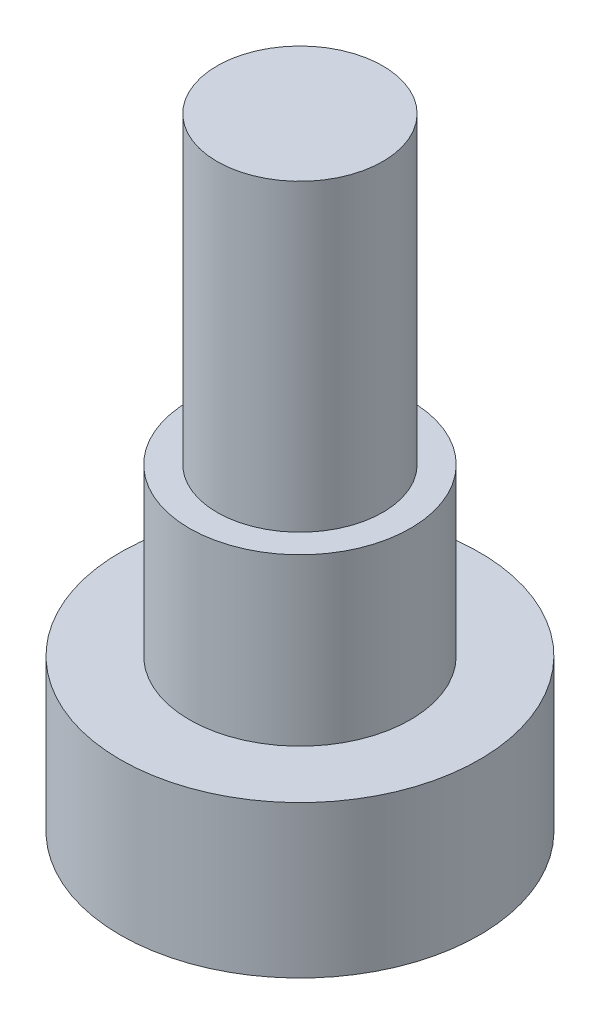
ISO-10303-21;
HEADER;
FILE_DESCRIPTION(('STEP AP214'),'2;1');
FILE_NAME('part.step','',(''),(''),'','','');
FILE_SCHEMA(('AUTOMOTIVE_DESIGN { 1 0 10303 214 1 1 1 1 }'));
ENDSEC;
DATA;
#1=APPLICATION_CONTEXT('core data for automotive mechanical design processes');
#2=APPLICATION_PROTOCOL_DEFINITION('international standard','automotive_design',2000,#1);
#3=PRODUCT_CONTEXT('',#1,'mechanical');
#4=PRODUCT('Part','Part','',(#3));
#5=PRODUCT_RELATED_PRODUCT_CATEGORY('part','',(#4));
#6=PRODUCT_DEFINITION_FORMATION('','',#4);
#7=PRODUCT_DEFINITION_CONTEXT('part definition',#1,'design');
#8=PRODUCT_DEFINITION('design','',#6,#7);
#9=PRODUCT_DEFINITION_SHAPE('','',#8);
#10=(LENGTH_UNIT() NAMED_UNIT(*) SI_UNIT(.MILLI.,.METRE.));
#11=(NAMED_UNIT(*) PLANE_ANGLE_UNIT() SI_UNIT($,.RADIAN.));
#12=(NAMED_UNIT(*) SI_UNIT($,.STERADIAN.) SOLID_ANGLE_UNIT());
#13=UNCERTAINTY_MEASURE_WITH_UNIT(LENGTH_MEASURE(1.E-05),#10,'distance_accuracy_value','');
#14=(GEOMETRIC_REPRESENTATION_CONTEXT(3) GLOBAL_UNCERTAINTY_ASSIGNED_CONTEXT((#13)) GLOBAL_UNIT_ASSIGNED_CONTEXT((#10,
#11,#12)) REPRESENTATION_CONTEXT('',''));
#15=CARTESIAN_POINT('',(0.,0.,0.));
#16=DIRECTION('',(0.,0.,1.));
#17=DIRECTION('',(1.,0.,0.));
#18=AXIS2_PLACEMENT_3D('',#15,#16,#17);
#19=CARTESIAN_POINT('',(0.,5.5,0.));
#20=DIRECTION('',(0.,-1.,0.));
#21=DIRECTION('',(0.,0.,-1.));
#22=AXIS2_PLACEMENT_3D('',#19,#20,#21);
#23=CYLINDRICAL_SURFACE('',#22,6.5);
#24=CARTESIAN_POINT('',(0.,5.5,0.));
#25=DIRECTION('',(0.,1.,0.));
#26=DIRECTION('',(0.,0.,1.));
#27=AXIS2_PLACEMENT_3D('',#24,#25,#26);
#28=CIRCLE('',#27,6.5);
#29=CARTESIAN_POINT('',(0.,5.5,6.5));
#30=VERTEX_POINT('',#29);
#31=EDGE_CURVE('E45',#30,#30,#28,.T.);
#32=ORIENTED_EDGE('',*,*,#31,.F.);
#33=EDGE_LOOP('',(#32));
#34=FACE_BOUND('',#33,.T.);
#35=CARTESIAN_POINT('',(0.,0.,0.));
#36=DIRECTION('',(0.,1.,0.));
#37=DIRECTION('',(0.,0.,1.));
#38=AXIS2_PLACEMENT_3D('',#35,#36,#37);
#39=CIRCLE('',#38,6.5);
#40=CARTESIAN_POINT('',(0.,0.,6.5));
#41=VERTEX_POINT('',#40);
#42=EDGE_CURVE('E36',#41,#41,#39,.T.);
#43=ORIENTED_EDGE('',*,*,#42,.T.);
#44=EDGE_LOOP('',(#43));
#45=FACE_BOUND('',#44,.T.);
#46=ADVANCED_FACE('F33',(#34,#45),#23,.T.);
#47=CARTESIAN_POINT('',(0.,5.5,0.));
#48=DIRECTION('',(0.,1.,0.));
#49=DIRECTION('',(0.,0.,1.));
#50=AXIS2_PLACEMENT_3D('',#47,#48,#49);
#51=PLANE('',#50);
#52=CARTESIAN_POINT('',(0.,5.5,0.));
#53=DIRECTION('',(0.,1.,0.));
#54=DIRECTION('',(0.,0.,1.));
#55=AXIS2_PLACEMENT_3D('',#52,#53,#54);
#56=CIRCLE('',#55,4.);
#57=CARTESIAN_POINT('',(0.,5.5,4.));
#58=VERTEX_POINT('',#57);
#59=EDGE_CURVE('E40',#58,#58,#56,.T.);
#60=ORIENTED_EDGE('',*,*,#59,.F.);
#61=EDGE_LOOP('',(#60));
#62=FACE_BOUND('',#61,.T.);
#63=ORIENTED_EDGE('',*,*,#31,.T.);
#64=EDGE_LOOP('',(#63));
#65=FACE_BOUND('',#64,.T.);
#66=ADVANCED_FACE('F62',(#62,#65),#51,.T.);
#67=CARTESIAN_POINT('',(0.,0.,0.));
#68=DIRECTION('',(0.,1.,0.));
#69=DIRECTION('',(0.,0.,1.));
#70=AXIS2_PLACEMENT_3D('',#67,#68,#69);
#71=PLANE('',#70);
#72=ORIENTED_EDGE('',*,*,#42,.F.);
#73=EDGE_LOOP('',(#72));
#74=FACE_BOUND('',#73,.T.);
#75=ADVANCED_FACE('F59',(#74),#71,.F.);
#76=CARTESIAN_POINT('',(0.,11.5,0.));
#77=DIRECTION('',(0.,-1.,0.));
#78=DIRECTION('',(0.,0.,-1.));
#79=AXIS2_PLACEMENT_3D('',#76,#77,#78);
#80=CYLINDRICAL_SURFACE('',#79,4.);
#81=CARTESIAN_POINT('',(0.,11.5,0.));
#82=DIRECTION('',(0.,1.,0.));
#83=DIRECTION('',(0.,0.,1.));
#84=AXIS2_PLACEMENT_3D('',#81,#82,#83);
#85=CIRCLE('',#84,4.);
#86=CARTESIAN_POINT('',(0.,11.5,4.));
#87=VERTEX_POINT('',#86);
#88=EDGE_CURVE('E50',#87,#87,#85,.T.);
#89=ORIENTED_EDGE('',*,*,#88,.F.);
#90=EDGE_LOOP('',(#89));
#91=FACE_BOUND('',#90,.T.);
#92=ORIENTED_EDGE('',*,*,#59,.T.);
#93=EDGE_LOOP('',(#92));
#94=FACE_BOUND('',#93,.T.);
#95=ADVANCED_FACE('F61',(#91,#94),#80,.T.);
#96=CARTESIAN_POINT('',(0.,11.5,0.));
#97=DIRECTION('',(0.,1.,0.));
#98=DIRECTION('',(0.,0.,1.));
#99=AXIS2_PLACEMENT_3D('',#96,#97,#98);
#100=PLANE('',#99);
#101=CARTESIAN_POINT('',(0.,11.5,0.));
#102=DIRECTION('',(0.,1.,0.));
#103=DIRECTION('',(0.,0.,1.));
#104=AXIS2_PLACEMENT_3D('',#101,#102,#103);
#105=CIRCLE('',#104,3.);
#106=CARTESIAN_POINT('',(0.,11.5,3.));
#107=VERTEX_POINT('',#106);
#108=EDGE_CURVE('E10',#107,#107,#105,.T.);
#109=ORIENTED_EDGE('',*,*,#108,.F.);
#110=EDGE_LOOP('',(#109));
#111=FACE_BOUND('',#110,.T.);
#112=ORIENTED_EDGE('',*,*,#88,.T.);
#113=EDGE_LOOP('',(#112));
#114=FACE_BOUND('',#113,.T.);
#115=ADVANCED_FACE('F67',(#111,#114),#100,.T.);
#116=CARTESIAN_POINT('',(0.,22.5,0.));
#117=DIRECTION('',(0.,-1.,0.));
#118=DIRECTION('',(0.,0.,-1.));
#119=AXIS2_PLACEMENT_3D('',#116,#117,#118);
#120=CYLINDRICAL_SURFACE('',#119,3.);
#121=CARTESIAN_POINT('',(0.,22.5,0.));
#122=DIRECTION('',(0.,1.,0.));
#123=DIRECTION('',(0.,0.,1.));
#124=AXIS2_PLACEMENT_3D('',#121,#122,#123);
#125=CIRCLE('',#124,3.);
#126=CARTESIAN_POINT('',(0.,22.5,3.));
#127=VERTEX_POINT('',#126);
#128=EDGE_CURVE('E49',#127,#127,#125,.T.);
#129=ORIENTED_EDGE('',*,*,#128,.F.);
#130=EDGE_LOOP('',(#129));
#131=FACE_BOUND('',#130,.T.);
#132=ORIENTED_EDGE('',*,*,#108,.T.);
#133=EDGE_LOOP('',(#132));
#134=FACE_BOUND('',#133,.T.);
#135=ADVANCED_FACE('F97',(#131,#134),#120,.T.);
#136=CARTESIAN_POINT('',(0.,22.5,0.));
#137=DIRECTION('',(0.,1.,0.));
#138=DIRECTION('',(0.,0.,1.));
#139=AXIS2_PLACEMENT_3D('',#136,#137,#138);
#140=PLANE('',#139);
#141=ORIENTED_EDGE('',*,*,#128,.T.);
#142=EDGE_LOOP('',(#141));
#143=FACE_BOUND('',#142,.T.);
#144=ADVANCED_FACE('F107',(#143),#140,.T.);
#145=CLOSED_SHELL('',(#46,#66,#75,#95,#115,#135,#144));
#146=MANIFOLD_SOLID_BREP('B2',#145);
#147=ADVANCED_BREP_SHAPE_REPRESENTATION('',(#18,#146),#14);
#148=SHAPE_DEFINITION_REPRESENTATION(#9,#147);
ENDSEC;
END-ISO-10303-21;
